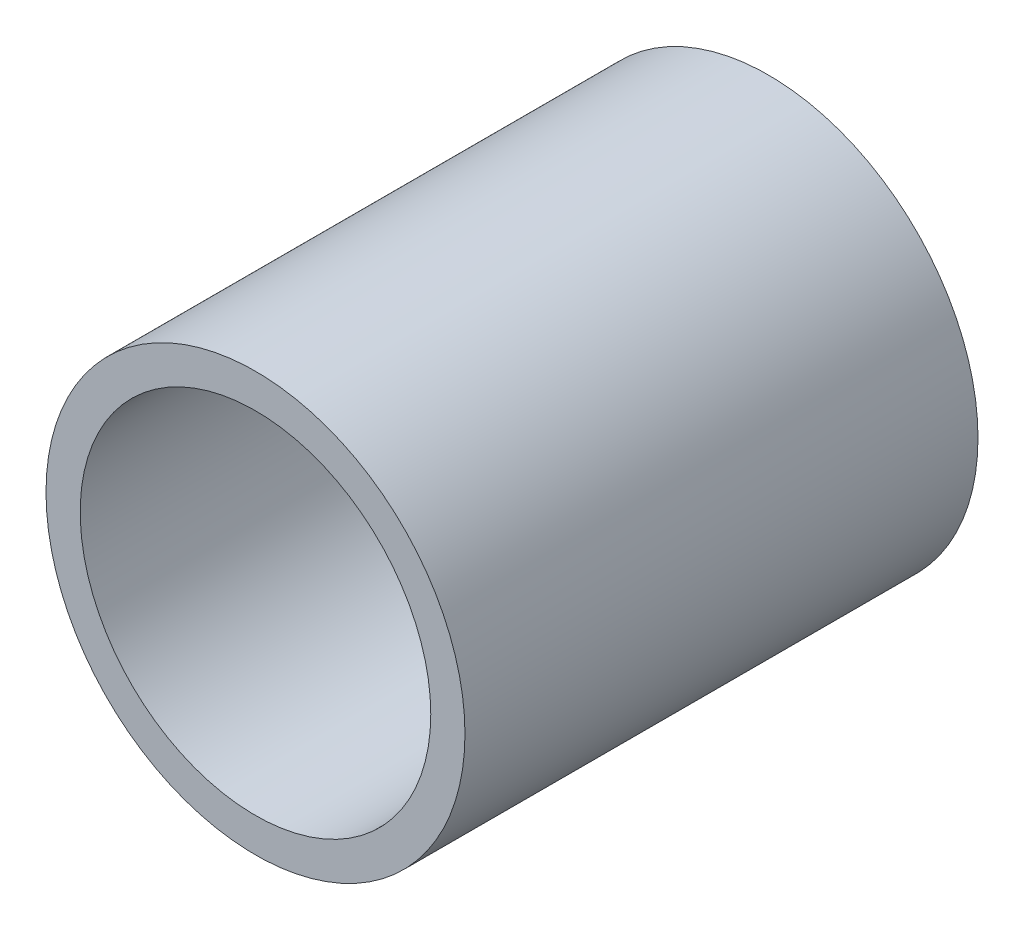
ISO-10303-21;
HEADER;
FILE_DESCRIPTION(('STEP AP214'),'2;1');
FILE_NAME('part.step','',(''),(''),'','','');
FILE_SCHEMA(('AUTOMOTIVE_DESIGN { 1 0 10303 214 1 1 1 1 }'));
ENDSEC;
DATA;
#1=APPLICATION_CONTEXT('core data for automotive mechanical design processes');
#2=APPLICATION_PROTOCOL_DEFINITION('international standard','automotive_design',2000,#1);
#3=PRODUCT_CONTEXT('',#1,'mechanical');
#4=PRODUCT('Part','Part','',(#3));
#5=PRODUCT_RELATED_PRODUCT_CATEGORY('part','',(#4));
#6=PRODUCT_DEFINITION_FORMATION('','',#4);
#7=PRODUCT_DEFINITION_CONTEXT('part definition',#1,'design');
#8=PRODUCT_DEFINITION('design','',#6,#7);
#9=PRODUCT_DEFINITION_SHAPE('','',#8);
#10=(LENGTH_UNIT() NAMED_UNIT(*) SI_UNIT(.MILLI.,.METRE.));
#11=(NAMED_UNIT(*) PLANE_ANGLE_UNIT() SI_UNIT($,.RADIAN.));
#12=(NAMED_UNIT(*) SI_UNIT($,.STERADIAN.) SOLID_ANGLE_UNIT());
#13=UNCERTAINTY_MEASURE_WITH_UNIT(LENGTH_MEASURE(1.E-05),#10,'distance_accuracy_value','');
#14=(GEOMETRIC_REPRESENTATION_CONTEXT(3) GLOBAL_UNCERTAINTY_ASSIGNED_CONTEXT((#13)) GLOBAL_UNIT_ASSIGNED_CONTEXT((#10,
#11,#12)) REPRESENTATION_CONTEXT('',''));
#15=CARTESIAN_POINT('',(0.,0.,0.));
#16=DIRECTION('',(0.,0.,1.));
#17=DIRECTION('',(1.,0.,0.));
#18=AXIS2_PLACEMENT_3D('',#15,#16,#17);
#19=CARTESIAN_POINT('',(0.,0.,15.));
#20=DIRECTION('',(0.,0.,1.));
#21=DIRECTION('',(1.,0.,0.));
#22=AXIS2_PLACEMENT_3D('',#19,#20,#21);
#23=PLANE('',#22);
#24=CARTESIAN_POINT('',(0.,0.,15.));
#25=DIRECTION('',(0.,0.,1.));
#26=DIRECTION('',(1.,0.,0.));
#27=AXIS2_PLACEMENT_3D('',#24,#25,#26);
#28=CIRCLE('',#27,6.125);
#29=CARTESIAN_POINT('',(6.125,0.,15.));
#30=VERTEX_POINT('',#29);
#31=EDGE_CURVE('E10',#30,#30,#28,.T.);
#32=ORIENTED_EDGE('',*,*,#31,.T.);
#33=EDGE_LOOP('',(#32));
#34=FACE_BOUND('',#33,.T.);
#35=CARTESIAN_POINT('',(0.,0.,15.));
#36=DIRECTION('',(0.,0.,1.));
#37=DIRECTION('',(1.,0.,0.));
#38=AXIS2_PLACEMENT_3D('',#35,#36,#37);
#39=CIRCLE('',#38,5.125);
#40=CARTESIAN_POINT('',(5.125,0.,15.));
#41=VERTEX_POINT('',#40);
#42=EDGE_CURVE('E48',#41,#41,#39,.T.);
#43=ORIENTED_EDGE('',*,*,#42,.F.);
#44=EDGE_LOOP('',(#43));
#45=FACE_BOUND('',#44,.T.);
#46=ADVANCED_FACE('F37',(#34,#45),#23,.T.);
#47=CARTESIAN_POINT('',(0.,0.,0.));
#48=DIRECTION('',(0.,0.,1.));
#49=DIRECTION('',(1.,0.,0.));
#50=AXIS2_PLACEMENT_3D('',#47,#48,#49);
#51=PLANE('',#50);
#52=CARTESIAN_POINT('',(0.,0.,0.));
#53=DIRECTION('',(0.,0.,1.));
#54=DIRECTION('',(1.,0.,0.));
#55=AXIS2_PLACEMENT_3D('',#52,#53,#54);
#56=CIRCLE('',#55,6.125);
#57=CARTESIAN_POINT('',(6.125,0.,0.));
#58=VERTEX_POINT('',#57);
#59=EDGE_CURVE('E41',#58,#58,#56,.T.);
#60=ORIENTED_EDGE('',*,*,#59,.F.);
#61=EDGE_LOOP('',(#60));
#62=FACE_BOUND('',#61,.T.);
#63=CARTESIAN_POINT('',(0.,0.,0.));
#64=DIRECTION('',(0.,0.,1.));
#65=DIRECTION('',(1.,0.,0.));
#66=AXIS2_PLACEMENT_3D('',#63,#64,#65);
#67=CIRCLE('',#66,5.125);
#68=CARTESIAN_POINT('',(5.125,0.,0.));
#69=VERTEX_POINT('',#68);
#70=EDGE_CURVE('E50',#69,#69,#67,.T.);
#71=ORIENTED_EDGE('',*,*,#70,.T.);
#72=EDGE_LOOP('',(#71));
#73=FACE_BOUND('',#72,.T.);
#74=ADVANCED_FACE('F60',(#62,#73),#51,.F.);
#75=CARTESIAN_POINT('',(0.,0.,15.));
#76=DIRECTION('',(0.,0.,-1.));
#77=DIRECTION('',(-1.,0.,0.));
#78=AXIS2_PLACEMENT_3D('',#75,#76,#77);
#79=CYLINDRICAL_SURFACE('',#78,6.125);
#80=ORIENTED_EDGE('',*,*,#31,.F.);
#81=EDGE_LOOP('',(#80));
#82=FACE_BOUND('',#81,.T.);
#83=ORIENTED_EDGE('',*,*,#59,.T.);
#84=EDGE_LOOP('',(#83));
#85=FACE_BOUND('',#84,.T.);
#86=ADVANCED_FACE('F39',(#82,#85),#79,.T.);
#87=CARTESIAN_POINT('',(0.,0.,15.));
#88=DIRECTION('',(0.,0.,-1.));
#89=DIRECTION('',(-1.,0.,0.));
#90=AXIS2_PLACEMENT_3D('',#87,#88,#89);
#91=CYLINDRICAL_SURFACE('',#90,5.125);
#92=ORIENTED_EDGE('',*,*,#42,.T.);
#93=EDGE_LOOP('',(#92));
#94=FACE_BOUND('',#93,.T.);
#95=ORIENTED_EDGE('',*,*,#70,.F.);
#96=EDGE_LOOP('',(#95));
#97=FACE_BOUND('',#96,.T.);
#98=ADVANCED_FACE('F56',(#94,#97),#91,.F.);
#99=CLOSED_SHELL('',(#46,#74,#86,#98));
#100=MANIFOLD_SOLID_BREP('B2',#99);
#101=ADVANCED_BREP_SHAPE_REPRESENTATION('',(#18,#100),#14);
#102=SHAPE_DEFINITION_REPRESENTATION(#9,#101);
ENDSEC;
END-ISO-10303-21;
